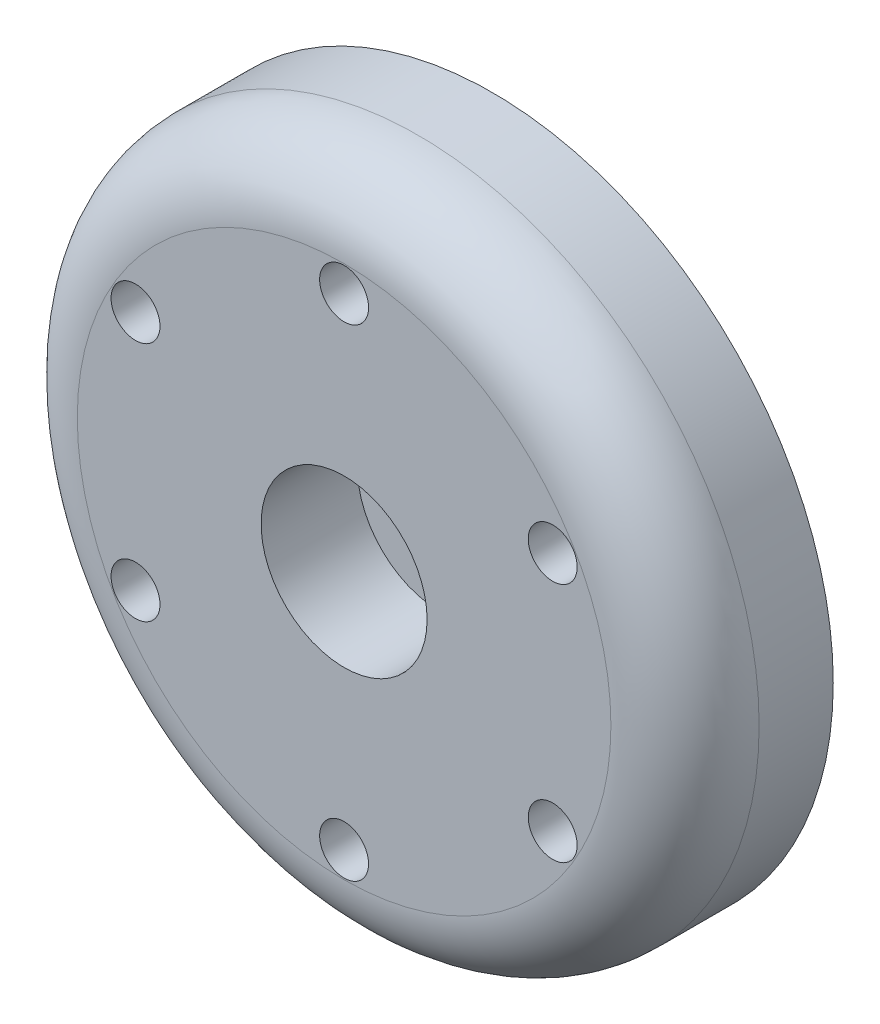
ISO-10303-21;
HEADER;
FILE_DESCRIPTION(('STEP AP214'),'2;1');
FILE_NAME('part.step','',(''),(''),'','','');
FILE_SCHEMA(('AUTOMOTIVE_DESIGN { 1 0 10303 214 1 1 1 1 }'));
ENDSEC;
DATA;
#1=APPLICATION_CONTEXT('core data for automotive mechanical design processes');
#2=APPLICATION_PROTOCOL_DEFINITION('international standard','automotive_design',2000,#1);
#3=PRODUCT_CONTEXT('',#1,'mechanical');
#4=PRODUCT('Part','Part','',(#3));
#5=PRODUCT_RELATED_PRODUCT_CATEGORY('part','',(#4));
#6=PRODUCT_DEFINITION_FORMATION('','',#4);
#7=PRODUCT_DEFINITION_CONTEXT('part definition',#1,'design');
#8=PRODUCT_DEFINITION('design','',#6,#7);
#9=PRODUCT_DEFINITION_SHAPE('','',#8);
#10=(LENGTH_UNIT() NAMED_UNIT(*) SI_UNIT(.MILLI.,.METRE.));
#11=(NAMED_UNIT(*) PLANE_ANGLE_UNIT() SI_UNIT($,.RADIAN.));
#12=(NAMED_UNIT(*) SI_UNIT($,.STERADIAN.) SOLID_ANGLE_UNIT());
#13=UNCERTAINTY_MEASURE_WITH_UNIT(LENGTH_MEASURE(1.E-05),#10,'distance_accuracy_value','');
#14=(GEOMETRIC_REPRESENTATION_CONTEXT(3) GLOBAL_UNCERTAINTY_ASSIGNED_CONTEXT((#13)) GLOBAL_UNIT_ASSIGNED_CONTEXT((#10,
#11,#12)) REPRESENTATION_CONTEXT('',''));
#15=CARTESIAN_POINT('',(0.,0.,0.));
#16=DIRECTION('',(0.,0.,1.));
#17=DIRECTION('',(1.,0.,0.));
#18=AXIS2_PLACEMENT_3D('',#15,#16,#17);
#19=CARTESIAN_POINT('',(0.,0.,10.));
#20=DIRECTION('',(0.,0.,-1.));
#21=DIRECTION('',(-1.,0.,0.));
#22=AXIS2_PLACEMENT_3D('',#19,#20,#21);
#23=CYLINDRICAL_SURFACE('',#22,23.);
#24=CARTESIAN_POINT('',(0.,0.,5.));
#25=DIRECTION('',(0.,0.,1.));
#26=DIRECTION('',(1.,0.,0.));
#27=AXIS2_PLACEMENT_3D('',#24,#25,#26);
#28=CIRCLE('',#27,23.);
#29=CARTESIAN_POINT('',(23.,0.,5.));
#30=VERTEX_POINT('',#29);
#31=EDGE_CURVE('E40',#30,#30,#28,.F.);
#32=ORIENTED_EDGE('',*,*,#31,.T.);
#33=EDGE_LOOP('',(#32));
#34=FACE_BOUND('',#33,.T.);
#35=CARTESIAN_POINT('',(0.,0.,0.));
#36=DIRECTION('',(0.,0.,-1.));
#37=DIRECTION('',(-1.,0.,0.));
#38=AXIS2_PLACEMENT_3D('',#35,#36,#37);
#39=CIRCLE('',#38,23.);
#40=CARTESIAN_POINT('',(-23.,0.,0.));
#41=VERTEX_POINT('',#40);
#42=EDGE_CURVE('E44',#41,#41,#39,.T.);
#43=ORIENTED_EDGE('',*,*,#42,.F.);
#44=EDGE_LOOP('',(#43));
#45=FACE_BOUND('',#44,.T.);
#46=ADVANCED_FACE('F33',(#34,#45),#23,.T.);
#47=CARTESIAN_POINT('',(23.,0.,10.));
#48=DIRECTION('',(0.,0.,1.));
#49=DIRECTION('',(1.,0.,0.));
#50=AXIS2_PLACEMENT_3D('',#47,#48,#49);
#51=PLANE('',#50);
#52=CARTESIAN_POINT('',(0.,0.,10.));
#53=DIRECTION('',(0.,0.,1.));
#54=DIRECTION('',(1.,0.,0.));
#55=AXIS2_PLACEMENT_3D('',#52,#53,#54);
#56=CIRCLE('',#55,18.);
#57=CARTESIAN_POINT('',(18.,0.,10.));
#58=VERTEX_POINT('',#57);
#59=EDGE_CURVE('E10',#58,#58,#56,.T.);
#60=ORIENTED_EDGE('',*,*,#59,.T.);
#61=EDGE_LOOP('',(#60));
#62=FACE_BOUND('',#61,.T.);
#63=CARTESIAN_POINT('',(0.,0.,10.));
#64=DIRECTION('',(0.,0.,1.));
#65=DIRECTION('',(1.,0.,0.));
#66=AXIS2_PLACEMENT_3D('',#63,#64,#65);
#67=CIRCLE('',#66,5.59999999999999);
#68=CARTESIAN_POINT('',(5.59999999999999,0.,10.));
#69=VERTEX_POINT('',#68);
#70=EDGE_CURVE('E107',#69,#69,#67,.T.);
#71=ORIENTED_EDGE('',*,*,#70,.F.);
#72=EDGE_LOOP('',(#71));
#73=FACE_BOUND('',#72,.T.);
#74=CARTESIAN_POINT('',(14.072912811497,8.12500000000017,10.));
#75=DIRECTION('',(0.,0.,1.));
#76=DIRECTION('',(1.,0.,0.));
#77=AXIS2_PLACEMENT_3D('',#74,#75,#76);
#78=CIRCLE('',#77,1.64999999999999);
#79=CARTESIAN_POINT('',(15.722912811497,8.12500000000017,10.));
#80=VERTEX_POINT('',#79);
#81=EDGE_CURVE('E55',#80,#80,#78,.T.);
#82=ORIENTED_EDGE('',*,*,#81,.F.);
#83=EDGE_LOOP('',(#82));
#84=FACE_BOUND('',#83,.T.);
#85=CARTESIAN_POINT('',(14.0729128114971,-8.12500000000001,10.));
#86=DIRECTION('',(0.,0.,1.));
#87=DIRECTION('',(1.,0.,0.));
#88=AXIS2_PLACEMENT_3D('',#85,#86,#87);
#89=CIRCLE('',#88,1.64999999999999);
#90=CARTESIAN_POINT('',(15.7229128114971,-8.12500000000001,10.));
#91=VERTEX_POINT('',#90);
#92=EDGE_CURVE('E54',#91,#91,#89,.T.);
#93=ORIENTED_EDGE('',*,*,#92,.F.);
#94=EDGE_LOOP('',(#93));
#95=FACE_BOUND('',#94,.T.);
#96=CARTESIAN_POINT('',(1.13473143512402E-13,-16.25,10.));
#97=DIRECTION('',(0.,0.,1.));
#98=DIRECTION('',(1.,0.,0.));
#99=AXIS2_PLACEMENT_3D('',#96,#97,#98);
#100=CIRCLE('',#99,1.64999999999999);
#101=CARTESIAN_POINT('',(1.6500000000001,-16.25,10.));
#102=VERTEX_POINT('',#101);
#103=EDGE_CURVE('E59',#102,#102,#100,.T.);
#104=ORIENTED_EDGE('',*,*,#103,.F.);
#105=EDGE_LOOP('',(#104));
#106=FACE_BOUND('',#105,.T.);
#107=CARTESIAN_POINT('',(-14.0729128114971,-8.12500000000007,10.));
#108=DIRECTION('',(0.,0.,1.));
#109=DIRECTION('',(1.,0.,0.));
#110=AXIS2_PLACEMENT_3D('',#107,#108,#109);
#111=CIRCLE('',#110,1.64999999999999);
#112=CARTESIAN_POINT('',(-12.4229128114971,-8.12500000000007,10.));
#113=VERTEX_POINT('',#112);
#114=EDGE_CURVE('E63',#113,#113,#111,.T.);
#115=ORIENTED_EDGE('',*,*,#114,.F.);
#116=EDGE_LOOP('',(#115));
#117=FACE_BOUND('',#116,.T.);
#118=CARTESIAN_POINT('',(-14.0729128114972,8.12499999999998,10.));
#119=DIRECTION('',(0.,0.,1.));
#120=DIRECTION('',(1.,0.,0.));
#121=AXIS2_PLACEMENT_3D('',#118,#119,#120);
#122=CIRCLE('',#121,1.64999999999999);
#123=CARTESIAN_POINT('',(-12.4229128114972,8.12499999999998,10.));
#124=VERTEX_POINT('',#123);
#125=EDGE_CURVE('E67',#124,#124,#122,.T.);
#126=ORIENTED_EDGE('',*,*,#125,.F.);
#127=EDGE_LOOP('',(#126));
#128=FACE_BOUND('',#127,.T.);
#129=CARTESIAN_POINT('',(0.,16.25,10.));
#130=DIRECTION('',(0.,0.,1.));
#131=DIRECTION('',(1.,0.,0.));
#132=AXIS2_PLACEMENT_3D('',#129,#130,#131);
#133=CIRCLE('',#132,1.64999999999999);
#134=CARTESIAN_POINT('',(1.64999999999999,16.25,10.));
#135=VERTEX_POINT('',#134);
#136=EDGE_CURVE('E71',#135,#135,#133,.T.);
#137=ORIENTED_EDGE('',*,*,#136,.F.);
#138=EDGE_LOOP('',(#137));
#139=FACE_BOUND('',#138,.T.);
#140=ADVANCED_FACE('F113',(#62,#73,#84,#95,#106,#117,#128,#139),#51,.T.);
#141=CARTESIAN_POINT('',(0.,0.,0.));
#142=DIRECTION('',(0.,0.,-1.));
#143=DIRECTION('',(-1.,0.,0.));
#144=AXIS2_PLACEMENT_3D('',#141,#142,#143);
#145=PLANE('',#144);
#146=CARTESIAN_POINT('',(0.,0.,0.));
#147=DIRECTION('',(0.,0.,-1.));
#148=DIRECTION('',(-1.,0.,0.));
#149=AXIS2_PLACEMENT_3D('',#146,#147,#148);
#150=CIRCLE('',#149,20.);
#151=CARTESIAN_POINT('',(-20.,0.,0.));
#152=VERTEX_POINT('',#151);
#153=EDGE_CURVE('E78',#152,#152,#150,.T.);
#154=ORIENTED_EDGE('',*,*,#153,.F.);
#155=EDGE_LOOP('',(#154));
#156=FACE_BOUND('',#155,.T.);
#157=ORIENTED_EDGE('',*,*,#42,.T.);
#158=EDGE_LOOP('',(#157));
#159=FACE_BOUND('',#158,.T.);
#160=ADVANCED_FACE('F116',(#156,#159),#145,.T.);
#161=CARTESIAN_POINT('',(0.,0.,5.8));
#162=DIRECTION('',(0.,0.,1.));
#163=DIRECTION('',(1.,0.,0.));
#164=AXIS2_PLACEMENT_3D('',#161,#162,#163);
#165=PLANE('',#164);
#166=CARTESIAN_POINT('',(14.072912811497,8.12500000000017,5.8));
#167=DIRECTION('',(0.,0.,1.));
#168=DIRECTION('',(1.,0.,0.));
#169=AXIS2_PLACEMENT_3D('',#166,#167,#168);
#170=CIRCLE('',#169,1.64999999999999);
#171=CARTESIAN_POINT('',(15.722912811497,8.12500000000017,5.8));
#172=VERTEX_POINT('',#171);
#173=EDGE_CURVE('E51',#172,#172,#170,.T.);
#174=ORIENTED_EDGE('',*,*,#173,.T.);
#175=EDGE_LOOP('',(#174));
#176=FACE_BOUND('',#175,.T.);
#177=CARTESIAN_POINT('',(14.0729128114971,-8.12500000000001,5.8));
#178=DIRECTION('',(0.,0.,1.));
#179=DIRECTION('',(1.,0.,0.));
#180=AXIS2_PLACEMENT_3D('',#177,#178,#179);
#181=CIRCLE('',#180,1.64999999999999);
#182=CARTESIAN_POINT('',(15.7229128114971,-8.12500000000001,5.8));
#183=VERTEX_POINT('',#182);
#184=EDGE_CURVE('E56',#183,#183,#181,.T.);
#185=ORIENTED_EDGE('',*,*,#184,.T.);
#186=EDGE_LOOP('',(#185));
#187=FACE_BOUND('',#186,.T.);
#188=CARTESIAN_POINT('',(1.13473143512402E-13,-16.25,5.8));
#189=DIRECTION('',(0.,0.,1.));
#190=DIRECTION('',(1.,0.,0.));
#191=AXIS2_PLACEMENT_3D('',#188,#189,#190);
#192=CIRCLE('',#191,1.64999999999999);
#193=CARTESIAN_POINT('',(1.6500000000001,-16.25,5.8));
#194=VERTEX_POINT('',#193);
#195=EDGE_CURVE('E60',#194,#194,#192,.T.);
#196=ORIENTED_EDGE('',*,*,#195,.T.);
#197=EDGE_LOOP('',(#196));
#198=FACE_BOUND('',#197,.T.);
#199=CARTESIAN_POINT('',(-14.0729128114971,-8.12500000000007,5.8));
#200=DIRECTION('',(0.,0.,1.));
#201=DIRECTION('',(1.,0.,0.));
#202=AXIS2_PLACEMENT_3D('',#199,#200,#201);
#203=CIRCLE('',#202,1.64999999999999);
#204=CARTESIAN_POINT('',(-12.4229128114971,-8.12500000000007,5.8));
#205=VERTEX_POINT('',#204);
#206=EDGE_CURVE('E64',#205,#205,#203,.T.);
#207=ORIENTED_EDGE('',*,*,#206,.T.);
#208=EDGE_LOOP('',(#207));
#209=FACE_BOUND('',#208,.T.);
#210=CARTESIAN_POINT('',(-14.0729128114972,8.12499999999998,5.8));
#211=DIRECTION('',(0.,0.,1.));
#212=DIRECTION('',(1.,0.,0.));
#213=AXIS2_PLACEMENT_3D('',#210,#211,#212);
#214=CIRCLE('',#213,1.64999999999999);
#215=CARTESIAN_POINT('',(-12.4229128114972,8.12499999999998,5.8));
#216=VERTEX_POINT('',#215);
#217=EDGE_CURVE('E68',#216,#216,#214,.T.);
#218=ORIENTED_EDGE('',*,*,#217,.T.);
#219=EDGE_LOOP('',(#218));
#220=FACE_BOUND('',#219,.T.);
#221=CARTESIAN_POINT('',(0.,16.25,5.8));
#222=DIRECTION('',(0.,0.,1.));
#223=DIRECTION('',(1.,0.,0.));
#224=AXIS2_PLACEMENT_3D('',#221,#222,#223);
#225=CIRCLE('',#224,1.64999999999999);
#226=CARTESIAN_POINT('',(1.64999999999999,16.25,5.8));
#227=VERTEX_POINT('',#226);
#228=EDGE_CURVE('E72',#227,#227,#225,.T.);
#229=ORIENTED_EDGE('',*,*,#228,.T.);
#230=EDGE_LOOP('',(#229));
#231=FACE_BOUND('',#230,.T.);
#232=CARTESIAN_POINT('',(0.,0.,5.8));
#233=DIRECTION('',(0.,0.,-1.));
#234=DIRECTION('',(-1.,0.,0.));
#235=AXIS2_PLACEMENT_3D('',#232,#233,#234);
#236=CIRCLE('',#235,12.5);
#237=CARTESIAN_POINT('',(-12.5,0.,5.8));
#238=VERTEX_POINT('',#237);
#239=EDGE_CURVE('E81',#238,#238,#236,.T.);
#240=ORIENTED_EDGE('',*,*,#239,.F.);
#241=EDGE_LOOP('',(#240));
#242=FACE_BOUND('',#241,.T.);
#243=CARTESIAN_POINT('',(0.,0.,5.8));
#244=DIRECTION('',(0.,0.,-1.));
#245=DIRECTION('',(-1.,0.,0.));
#246=AXIS2_PLACEMENT_3D('',#243,#244,#245);
#247=CIRCLE('',#246,20.);
#248=CARTESIAN_POINT('',(-20.,0.,5.8));
#249=VERTEX_POINT('',#248);
#250=EDGE_CURVE('E48',#249,#249,#247,.T.);
#251=ORIENTED_EDGE('',*,*,#250,.T.);
#252=EDGE_LOOP('',(#251));
#253=FACE_BOUND('',#252,.T.);
#254=ADVANCED_FACE('F138',(#176,#187,#198,#209,#220,#231,#242,#253),#165,.F.);
#255=CARTESIAN_POINT('',(0.,0.,0.));
#256=DIRECTION('',(0.,0.,-1.));
#257=DIRECTION('',(-1.,0.,0.));
#258=AXIS2_PLACEMENT_3D('',#255,#256,#257);
#259=CYLINDRICAL_SURFACE('',#258,20.);
#260=ORIENTED_EDGE('',*,*,#250,.F.);
#261=EDGE_LOOP('',(#260));
#262=FACE_BOUND('',#261,.T.);
#263=ORIENTED_EDGE('',*,*,#153,.T.);
#264=EDGE_LOOP('',(#263));
#265=FACE_BOUND('',#264,.T.);
#266=ADVANCED_FACE('F141',(#262,#265),#259,.F.);
#267=CARTESIAN_POINT('',(0.,0.,5.8));
#268=DIRECTION('',(0.,0.,-1.));
#269=DIRECTION('',(-1.,0.,0.));
#270=AXIS2_PLACEMENT_3D('',#267,#268,#269);
#271=CYLINDRICAL_SURFACE('',#270,12.5);
#272=ORIENTED_EDGE('',*,*,#239,.T.);
#273=EDGE_LOOP('',(#272));
#274=FACE_BOUND('',#273,.T.);
#275=CARTESIAN_POINT('',(0.,0.,0.));
#276=DIRECTION('',(0.,0.,-1.));
#277=DIRECTION('',(-1.,0.,0.));
#278=AXIS2_PLACEMENT_3D('',#275,#276,#277);
#279=CIRCLE('',#278,12.5);
#280=CARTESIAN_POINT('',(-12.5,0.,0.));
#281=VERTEX_POINT('',#280);
#282=EDGE_CURVE('E74',#281,#281,#279,.T.);
#283=ORIENTED_EDGE('',*,*,#282,.F.);
#284=EDGE_LOOP('',(#283));
#285=FACE_BOUND('',#284,.T.);
#286=ADVANCED_FACE('F150',(#274,#285),#271,.T.);
#287=CARTESIAN_POINT('',(0.,0.,0.));
#288=DIRECTION('',(0.,0.,-1.));
#289=DIRECTION('',(-1.,0.,0.));
#290=AXIS2_PLACEMENT_3D('',#287,#288,#289);
#291=PLANE('',#290);
#292=CARTESIAN_POINT('',(0.,0.,0.));
#293=DIRECTION('',(0.,0.,1.));
#294=DIRECTION('',(1.,0.,0.));
#295=AXIS2_PLACEMENT_3D('',#292,#293,#294);
#296=CIRCLE('',#295,3.02250000000001);
#297=CARTESIAN_POINT('',(3.02250000000001,0.,0.));
#298=VERTEX_POINT('',#297);
#299=EDGE_CURVE('E98',#298,#298,#296,.T.);
#300=ORIENTED_EDGE('',*,*,#299,.T.);
#301=EDGE_LOOP('',(#300));
#302=FACE_BOUND('',#301,.T.);
#303=ORIENTED_EDGE('',*,*,#282,.T.);
#304=EDGE_LOOP('',(#303));
#305=FACE_BOUND('',#304,.T.);
#306=ADVANCED_FACE('F134',(#302,#305),#291,.T.);
#307=CARTESIAN_POINT('',(0.,16.25,10.));
#308=DIRECTION('',(0.,0.,1.));
#309=DIRECTION('',(1.,0.,0.));
#310=AXIS2_PLACEMENT_3D('',#307,#308,#309);
#311=CYLINDRICAL_SURFACE('',#310,1.64999999999999);
#312=ORIENTED_EDGE('',*,*,#136,.T.);
#313=EDGE_LOOP('',(#312));
#314=FACE_BOUND('',#313,.T.);
#315=ORIENTED_EDGE('',*,*,#228,.F.);
#316=EDGE_LOOP('',(#315));
#317=FACE_BOUND('',#316,.T.);
#318=ADVANCED_FACE('F130',(#314,#317),#311,.F.);
#319=CARTESIAN_POINT('',(-14.0729128114972,8.12499999999998,10.));
#320=DIRECTION('',(0.,0.,1.));
#321=DIRECTION('',(1.,0.,0.));
#322=AXIS2_PLACEMENT_3D('',#319,#320,#321);
#323=CYLINDRICAL_SURFACE('',#322,1.64999999999999);
#324=ORIENTED_EDGE('',*,*,#125,.T.);
#325=EDGE_LOOP('',(#324));
#326=FACE_BOUND('',#325,.T.);
#327=ORIENTED_EDGE('',*,*,#217,.F.);
#328=EDGE_LOOP('',(#327));
#329=FACE_BOUND('',#328,.T.);
#330=ADVANCED_FACE('F133',(#326,#329),#323,.F.);
#331=CARTESIAN_POINT('',(-14.0729128114971,-8.12500000000007,10.));
#332=DIRECTION('',(0.,0.,1.));
#333=DIRECTION('',(1.,0.,0.));
#334=AXIS2_PLACEMENT_3D('',#331,#332,#333);
#335=CYLINDRICAL_SURFACE('',#334,1.64999999999999);
#336=ORIENTED_EDGE('',*,*,#114,.T.);
#337=EDGE_LOOP('',(#336));
#338=FACE_BOUND('',#337,.T.);
#339=ORIENTED_EDGE('',*,*,#206,.F.);
#340=EDGE_LOOP('',(#339));
#341=FACE_BOUND('',#340,.T.);
#342=ADVANCED_FACE('F171',(#338,#341),#335,.F.);
#343=CARTESIAN_POINT('',(1.13473143512402E-13,-16.25,10.));
#344=DIRECTION('',(0.,0.,1.));
#345=DIRECTION('',(1.,0.,0.));
#346=AXIS2_PLACEMENT_3D('',#343,#344,#345);
#347=CYLINDRICAL_SURFACE('',#346,1.64999999999999);
#348=ORIENTED_EDGE('',*,*,#103,.T.);
#349=EDGE_LOOP('',(#348));
#350=FACE_BOUND('',#349,.T.);
#351=ORIENTED_EDGE('',*,*,#195,.F.);
#352=EDGE_LOOP('',(#351));
#353=FACE_BOUND('',#352,.T.);
#354=ADVANCED_FACE('F175',(#350,#353),#347,.F.);
#355=CARTESIAN_POINT('',(14.0729128114971,-8.12500000000001,10.));
#356=DIRECTION('',(0.,0.,1.));
#357=DIRECTION('',(1.,0.,0.));
#358=AXIS2_PLACEMENT_3D('',#355,#356,#357);
#359=CYLINDRICAL_SURFACE('',#358,1.64999999999999);
#360=ORIENTED_EDGE('',*,*,#92,.T.);
#361=EDGE_LOOP('',(#360));
#362=FACE_BOUND('',#361,.T.);
#363=ORIENTED_EDGE('',*,*,#184,.F.);
#364=EDGE_LOOP('',(#363));
#365=FACE_BOUND('',#364,.T.);
#366=ADVANCED_FACE('F179',(#362,#365),#359,.F.);
#367=CARTESIAN_POINT('',(14.072912811497,8.12500000000017,10.));
#368=DIRECTION('',(0.,0.,1.));
#369=DIRECTION('',(1.,0.,0.));
#370=AXIS2_PLACEMENT_3D('',#367,#368,#369);
#371=CYLINDRICAL_SURFACE('',#370,1.64999999999999);
#372=ORIENTED_EDGE('',*,*,#81,.T.);
#373=EDGE_LOOP('',(#372));
#374=FACE_BOUND('',#373,.T.);
#375=ORIENTED_EDGE('',*,*,#173,.F.);
#376=EDGE_LOOP('',(#375));
#377=FACE_BOUND('',#376,.T.);
#378=ADVANCED_FACE('F183',(#374,#377),#371,.F.);
#379=CARTESIAN_POINT('',(0.,0.,10.));
#380=DIRECTION('',(0.,0.,1.));
#381=DIRECTION('',(1.,0.,0.));
#382=AXIS2_PLACEMENT_3D('',#379,#380,#381);
#383=CYLINDRICAL_SURFACE('',#382,3.02250000000001);
#384=ORIENTED_EDGE('',*,*,#299,.F.);
#385=EDGE_LOOP('',(#384));
#386=FACE_BOUND('',#385,.T.);
#387=CARTESIAN_POINT('',(0.,0.,3.5));
#388=DIRECTION('',(0.,0.,1.));
#389=DIRECTION('',(1.,0.,0.));
#390=AXIS2_PLACEMENT_3D('',#387,#388,#389);
#391=CIRCLE('',#390,3.02250000000001);
#392=CARTESIAN_POINT('',(3.02250000000001,0.,3.5));
#393=VERTEX_POINT('',#392);
#394=EDGE_CURVE('E101',#393,#393,#391,.T.);
#395=ORIENTED_EDGE('',*,*,#394,.T.);
#396=EDGE_LOOP('',(#395));
#397=FACE_BOUND('',#396,.T.);
#398=ADVANCED_FACE('F187',(#386,#397),#383,.F.);
#399=CARTESIAN_POINT('',(3.02250000000001,0.,3.5));
#400=DIRECTION('',(0.,0.,-1.));
#401=DIRECTION('',(-1.,0.,0.));
#402=AXIS2_PLACEMENT_3D('',#399,#400,#401);
#403=PLANE('',#402);
#404=ORIENTED_EDGE('',*,*,#394,.F.);
#405=EDGE_LOOP('',(#404));
#406=FACE_BOUND('',#405,.T.);
#407=CARTESIAN_POINT('',(0.,0.,3.5));
#408=DIRECTION('',(0.,0.,1.));
#409=DIRECTION('',(1.,0.,0.));
#410=AXIS2_PLACEMENT_3D('',#407,#408,#409);
#411=CIRCLE('',#410,5.59999999999999);
#412=CARTESIAN_POINT('',(5.59999999999999,0.,3.5));
#413=VERTEX_POINT('',#412);
#414=EDGE_CURVE('E104',#413,#413,#411,.T.);
#415=ORIENTED_EDGE('',*,*,#414,.T.);
#416=EDGE_LOOP('',(#415));
#417=FACE_BOUND('',#416,.T.);
#418=ADVANCED_FACE('F191',(#406,#417),#403,.F.);
#419=CARTESIAN_POINT('',(0.,0.,10.));
#420=DIRECTION('',(0.,0.,1.));
#421=DIRECTION('',(1.,0.,0.));
#422=AXIS2_PLACEMENT_3D('',#419,#420,#421);
#423=CYLINDRICAL_SURFACE('',#422,5.59999999999999);
#424=ORIENTED_EDGE('',*,*,#414,.F.);
#425=EDGE_LOOP('',(#424));
#426=FACE_BOUND('',#425,.T.);
#427=ORIENTED_EDGE('',*,*,#70,.T.);
#428=EDGE_LOOP('',(#427));
#429=FACE_BOUND('',#428,.T.);
#430=ADVANCED_FACE('F111',(#426,#429),#423,.F.);
#431=CARTESIAN_POINT('',(0.,0.,5.));
#432=DIRECTION('',(0.,0.,1.));
#433=DIRECTION('',(1.,0.,0.));
#434=AXIS2_PLACEMENT_3D('',#431,#432,#433);
#435=TOROIDAL_SURFACE('',#434,18.,5.);
#436=ORIENTED_EDGE('',*,*,#59,.F.);
#437=EDGE_LOOP('',(#436));
#438=FACE_BOUND('',#437,.T.);
#439=ORIENTED_EDGE('',*,*,#31,.F.);
#440=EDGE_LOOP('',(#439));
#441=FACE_BOUND('',#440,.T.);
#442=ADVANCED_FACE('F35',(#438,#441),#435,.T.);
#443=CLOSED_SHELL('',(#46,#140,#160,#254,#266,#286,#306,#318,#330,#342,#354,#366,#378,#398,#418,
#430,#442));
#444=MANIFOLD_SOLID_BREP('B2',#443);
#445=ADVANCED_BREP_SHAPE_REPRESENTATION('',(#18,#444),#14);
#446=SHAPE_DEFINITION_REPRESENTATION(#9,#445);
ENDSEC;
END-ISO-10303-21;
